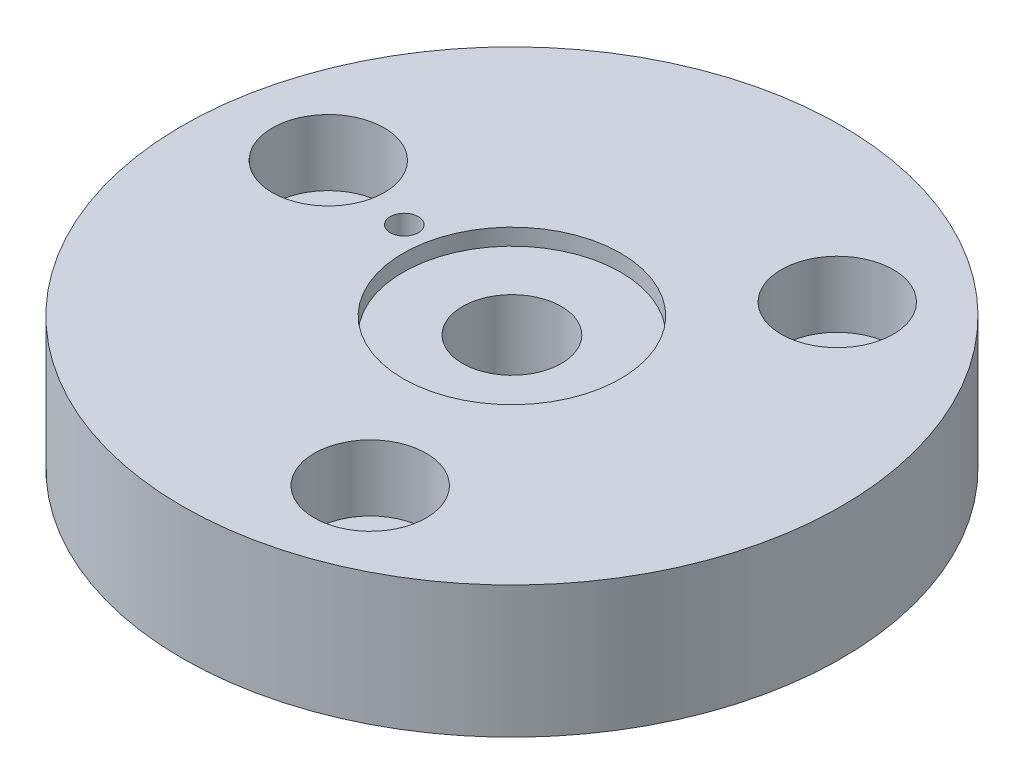
ISO-10303-21;
HEADER;
FILE_DESCRIPTION(('STEP AP214'),'2;1');
FILE_NAME('part.step','',(''),(''),'','','');
FILE_SCHEMA(('AUTOMOTIVE_DESIGN { 1 0 10303 214 1 1 1 1 }'));
ENDSEC;
DATA;
#1=APPLICATION_CONTEXT('core data for automotive mechanical design processes');
#2=APPLICATION_PROTOCOL_DEFINITION('international standard','automotive_design',2000,#1);
#3=PRODUCT_CONTEXT('',#1,'mechanical');
#4=PRODUCT('Part','Part','',(#3));
#5=PRODUCT_RELATED_PRODUCT_CATEGORY('part','',(#4));
#6=PRODUCT_DEFINITION_FORMATION('','',#4);
#7=PRODUCT_DEFINITION_CONTEXT('part definition',#1,'design');
#8=PRODUCT_DEFINITION('design','',#6,#7);
#9=PRODUCT_DEFINITION_SHAPE('','',#8);
#10=(LENGTH_UNIT() NAMED_UNIT(*) SI_UNIT(.MILLI.,.METRE.));
#11=(NAMED_UNIT(*) PLANE_ANGLE_UNIT() SI_UNIT($,.RADIAN.));
#12=(NAMED_UNIT(*) SI_UNIT($,.STERADIAN.) SOLID_ANGLE_UNIT());
#13=UNCERTAINTY_MEASURE_WITH_UNIT(LENGTH_MEASURE(1.E-05),#10,'distance_accuracy_value','');
#14=(GEOMETRIC_REPRESENTATION_CONTEXT(3) GLOBAL_UNCERTAINTY_ASSIGNED_CONTEXT((#13)) GLOBAL_UNIT_ASSIGNED_CONTEXT((#10,
#11,#12)) REPRESENTATION_CONTEXT('',''));
#15=CARTESIAN_POINT('',(0.,0.,0.));
#16=DIRECTION('',(0.,0.,1.));
#17=DIRECTION('',(1.,0.,0.));
#18=AXIS2_PLACEMENT_3D('',#15,#16,#17);
#19=CARTESIAN_POINT('',(45.8020488014566,-40.,-53.1696160562119));
#20=DIRECTION('',(0.,1.,0.));
#21=DIRECTION('',(0.,0.,1.));
#22=AXIS2_PLACEMENT_3D('',#19,#20,#21);
#23=CYLINDRICAL_SURFACE('',#22,8.0000000000045);
#24=CARTESIAN_POINT('',(45.8020488014566,-40.,-53.1696160562119));
#25=DIRECTION('',(0.,1.,0.));
#26=DIRECTION('',(0.,0.,1.));
#27=AXIS2_PLACEMENT_3D('',#24,#25,#26);
#28=CIRCLE('',#27,8.0000000000045);
#29=CARTESIAN_POINT('',(45.8020488014566,-40.,-45.1696160562074));
#30=VERTEX_POINT('',#29);
#31=EDGE_CURVE('E101',#30,#30,#28,.T.);
#32=ORIENTED_EDGE('',*,*,#31,.F.);
#33=EDGE_LOOP('',(#32));
#34=FACE_BOUND('',#33,.T.);
#35=CARTESIAN_POINT('',(45.8020488014566,-20.,-53.1696160562119));
#36=DIRECTION('',(0.,1.,0.));
#37=DIRECTION('',(0.,0.,1.));
#38=AXIS2_PLACEMENT_3D('',#35,#36,#37);
#39=CIRCLE('',#38,8.0000000000045);
#40=CARTESIAN_POINT('',(45.8020488014566,-20.,-45.1696160562074));
#41=VERTEX_POINT('',#40);
#42=EDGE_CURVE('E37',#41,#41,#39,.F.);
#43=ORIENTED_EDGE('',*,*,#42,.F.);
#44=EDGE_LOOP('',(#43));
#45=FACE_BOUND('',#44,.T.);
#46=ADVANCED_FACE('F33',(#34,#45),#23,.F.);
#47=CARTESIAN_POINT('',(23.1452138134145,-40.,66.2505458355371));
#48=DIRECTION('',(0.,1.,0.));
#49=DIRECTION('',(0.,0.,1.));
#50=AXIS2_PLACEMENT_3D('',#47,#48,#49);
#51=CYLINDRICAL_SURFACE('',#50,8.00000000000015);
#52=CARTESIAN_POINT('',(23.1452138134145,-40.,66.2505458355371));
#53=DIRECTION('',(0.,1.,0.));
#54=DIRECTION('',(0.,0.,1.));
#55=AXIS2_PLACEMENT_3D('',#52,#53,#54);
#56=CIRCLE('',#55,8.00000000000015);
#57=CARTESIAN_POINT('',(23.1452138134145,-40.,74.2505458355372));
#58=VERTEX_POINT('',#57);
#59=EDGE_CURVE('E57',#58,#58,#56,.T.);
#60=ORIENTED_EDGE('',*,*,#59,.F.);
#61=EDGE_LOOP('',(#60));
#62=FACE_BOUND('',#61,.T.);
#63=CARTESIAN_POINT('',(23.1452138134145,-20.,66.2505458355371));
#64=DIRECTION('',(0.,1.,0.));
#65=DIRECTION('',(0.,0.,1.));
#66=AXIS2_PLACEMENT_3D('',#63,#64,#65);
#67=CIRCLE('',#66,8.00000000000015);
#68=CARTESIAN_POINT('',(23.1452138134145,-20.,74.2505458355372));
#69=VERTEX_POINT('',#68);
#70=EDGE_CURVE('E70',#69,#69,#67,.F.);
#71=ORIENTED_EDGE('',*,*,#70,.F.);
#72=EDGE_LOOP('',(#71));
#73=FACE_BOUND('',#72,.T.);
#74=ADVANCED_FACE('F35',(#62,#73),#51,.F.);
#75=CARTESIAN_POINT('',(-68.9472626148694,-40.,-13.080929779334));
#76=DIRECTION('',(0.,1.,0.));
#77=DIRECTION('',(0.,0.,1.));
#78=AXIS2_PLACEMENT_3D('',#75,#76,#77);
#79=CYLINDRICAL_SURFACE('',#78,8.);
#80=CARTESIAN_POINT('',(-68.9472626148694,-40.,-13.080929779334));
#81=DIRECTION('',(0.,1.,0.));
#82=DIRECTION('',(0.,0.,1.));
#83=AXIS2_PLACEMENT_3D('',#80,#81,#82);
#84=CIRCLE('',#83,8.);
#85=CARTESIAN_POINT('',(-68.9472626148694,-40.,-5.08092977933395));
#86=VERTEX_POINT('',#85);
#87=EDGE_CURVE('E46',#86,#86,#84,.T.);
#88=ORIENTED_EDGE('',*,*,#87,.F.);
#89=EDGE_LOOP('',(#88));
#90=FACE_BOUND('',#89,.T.);
#91=CARTESIAN_POINT('',(-68.9472626148694,-20.,-13.080929779334));
#92=DIRECTION('',(0.,1.,0.));
#93=DIRECTION('',(0.,0.,1.));
#94=AXIS2_PLACEMENT_3D('',#91,#92,#93);
#95=CIRCLE('',#94,8.);
#96=CARTESIAN_POINT('',(-68.9472626148694,-20.,-5.08092977933395));
#97=VERTEX_POINT('',#96);
#98=EDGE_CURVE('E66',#97,#97,#95,.F.);
#99=ORIENTED_EDGE('',*,*,#98,.F.);
#100=EDGE_LOOP('',(#99));
#101=FACE_BOUND('',#100,.T.);
#102=ADVANCED_FACE('F109',(#90,#101),#79,.F.);
#103=CARTESIAN_POINT('',(0.,-30.,0.));
#104=DIRECTION('',(0.,1.,0.));
#105=DIRECTION('',(0.,0.,1.));
#106=AXIS2_PLACEMENT_3D('',#103,#104,#105);
#107=CYLINDRICAL_SURFACE('',#106,15.);
#108=CARTESIAN_POINT('',(0.,-30.,0.));
#109=DIRECTION('',(0.,1.,0.));
#110=DIRECTION('',(0.,0.,1.));
#111=AXIS2_PLACEMENT_3D('',#108,#109,#110);
#112=CIRCLE('',#111,15.);
#113=CARTESIAN_POINT('',(0.,-30.,15.));
#114=VERTEX_POINT('',#113);
#115=EDGE_CURVE('E61',#114,#114,#112,.T.);
#116=ORIENTED_EDGE('',*,*,#115,.F.);
#117=EDGE_LOOP('',(#116));
#118=FACE_BOUND('',#117,.T.);
#119=CARTESIAN_POINT('',(0.,-5.,0.));
#120=DIRECTION('',(0.,1.,0.));
#121=DIRECTION('',(0.,0.,1.));
#122=AXIS2_PLACEMENT_3D('',#119,#120,#121);
#123=CIRCLE('',#122,15.);
#124=CARTESIAN_POINT('',(0.,-5.,15.));
#125=VERTEX_POINT('',#124);
#126=EDGE_CURVE('E62',#125,#125,#123,.F.);
#127=ORIENTED_EDGE('',*,*,#126,.F.);
#128=EDGE_LOOP('',(#127));
#129=FACE_BOUND('',#128,.T.);
#130=ADVANCED_FACE('F112',(#118,#129),#107,.F.);
#131=CARTESIAN_POINT('',(0.,-40.,0.));
#132=DIRECTION('',(0.,1.,0.));
#133=DIRECTION('',(0.,0.,1.));
#134=AXIS2_PLACEMENT_3D('',#131,#132,#133);
#135=CYLINDRICAL_SURFACE('',#134,5.);
#136=CARTESIAN_POINT('',(0.,-40.,0.));
#137=DIRECTION('',(0.,1.,0.));
#138=DIRECTION('',(0.,0.,1.));
#139=AXIS2_PLACEMENT_3D('',#136,#137,#138);
#140=CIRCLE('',#139,5.);
#141=CARTESIAN_POINT('',(0.,-40.,5.));
#142=VERTEX_POINT('',#141);
#143=EDGE_CURVE('E54',#142,#142,#140,.T.);
#144=ORIENTED_EDGE('',*,*,#143,.F.);
#145=EDGE_LOOP('',(#144));
#146=FACE_BOUND('',#145,.T.);
#147=CARTESIAN_POINT('',(0.,-30.,0.));
#148=DIRECTION('',(0.,1.,0.));
#149=DIRECTION('',(0.,0.,1.));
#150=AXIS2_PLACEMENT_3D('',#147,#148,#149);
#151=CIRCLE('',#150,5.);
#152=CARTESIAN_POINT('',(0.,-30.,5.));
#153=VERTEX_POINT('',#152);
#154=EDGE_CURVE('E58',#153,#153,#151,.F.);
#155=ORIENTED_EDGE('',*,*,#154,.F.);
#156=EDGE_LOOP('',(#155));
#157=FACE_BOUND('',#156,.T.);
#158=ADVANCED_FACE('F146',(#146,#157),#135,.F.);
#159=CARTESIAN_POINT('',(-40.311740852345,-40.,-7.64809263447844));
#160=DIRECTION('',(0.,1.,0.));
#161=DIRECTION('',(0.,0.,1.));
#162=AXIS2_PLACEMENT_3D('',#159,#160,#161);
#163=CYLINDRICAL_SURFACE('',#162,4.25000000000001);
#164=CARTESIAN_POINT('',(-40.311740852345,-40.,-7.64809263447844));
#165=DIRECTION('',(0.,1.,0.));
#166=DIRECTION('',(0.,0.,1.));
#167=AXIS2_PLACEMENT_3D('',#164,#165,#166);
#168=CIRCLE('',#167,4.25000000000001);
#169=CARTESIAN_POINT('',(-40.311740852345,-40.,-3.39809263447844));
#170=VERTEX_POINT('',#169);
#171=EDGE_CURVE('E41',#170,#170,#168,.T.);
#172=ORIENTED_EDGE('',*,*,#171,.F.);
#173=EDGE_LOOP('',(#172));
#174=FACE_BOUND('',#173,.T.);
#175=CARTESIAN_POINT('',(-40.311740852345,0.,-7.64809263447844));
#176=DIRECTION('',(0.,1.,0.));
#177=DIRECTION('',(0.,0.,1.));
#178=AXIS2_PLACEMENT_3D('',#175,#176,#177);
#179=CIRCLE('',#178,4.25000000000001);
#180=CARTESIAN_POINT('',(-40.311740852345,0.,-3.39809263447844));
#181=VERTEX_POINT('',#180);
#182=EDGE_CURVE('E50',#181,#181,#179,.T.);
#183=ORIENTED_EDGE('',*,*,#182,.T.);
#184=EDGE_LOOP('',(#183));
#185=FACE_BOUND('',#184,.T.);
#186=ADVANCED_FACE('F142',(#174,#185),#163,.F.);
#187=CARTESIAN_POINT('',(0.,-40.,0.));
#188=DIRECTION('',(0.,1.,0.));
#189=DIRECTION('',(0.,0.,1.));
#190=AXIS2_PLACEMENT_3D('',#187,#188,#189);
#191=CYLINDRICAL_SURFACE('',#190,100.);
#192=CARTESIAN_POINT('',(0.,-40.,0.));
#193=DIRECTION('',(0.,1.,0.));
#194=DIRECTION('',(0.,0.,1.));
#195=AXIS2_PLACEMENT_3D('',#192,#193,#194);
#196=CIRCLE('',#195,100.);
#197=CARTESIAN_POINT('',(0.,-40.,100.));
#198=VERTEX_POINT('',#197);
#199=EDGE_CURVE('E10',#198,#198,#196,.T.);
#200=ORIENTED_EDGE('',*,*,#199,.T.);
#201=EDGE_LOOP('',(#200));
#202=FACE_BOUND('',#201,.T.);
#203=CARTESIAN_POINT('',(0.,0.,0.));
#204=DIRECTION('',(0.,1.,0.));
#205=DIRECTION('',(0.,0.,1.));
#206=AXIS2_PLACEMENT_3D('',#203,#204,#205);
#207=CIRCLE('',#206,100.);
#208=CARTESIAN_POINT('',(0.,0.,100.));
#209=VERTEX_POINT('',#208);
#210=EDGE_CURVE('E53',#209,#209,#207,.T.);
#211=ORIENTED_EDGE('',*,*,#210,.F.);
#212=EDGE_LOOP('',(#211));
#213=FACE_BOUND('',#212,.T.);
#214=ADVANCED_FACE('F145',(#202,#213),#191,.T.);
#215=CARTESIAN_POINT('',(0.,-40.,0.));
#216=DIRECTION('',(0.,1.,0.));
#217=DIRECTION('',(0.,0.,1.));
#218=AXIS2_PLACEMENT_3D('',#215,#216,#217);
#219=PLANE('',#218);
#220=ORIENTED_EDGE('',*,*,#143,.T.);
#221=EDGE_LOOP('',(#220));
#222=FACE_BOUND('',#221,.T.);
#223=ORIENTED_EDGE('',*,*,#59,.T.);
#224=EDGE_LOOP('',(#223));
#225=FACE_BOUND('',#224,.T.);
#226=ORIENTED_EDGE('',*,*,#31,.T.);
#227=EDGE_LOOP('',(#226));
#228=FACE_BOUND('',#227,.T.);
#229=ORIENTED_EDGE('',*,*,#87,.T.);
#230=EDGE_LOOP('',(#229));
#231=FACE_BOUND('',#230,.T.);
#232=ORIENTED_EDGE('',*,*,#171,.T.);
#233=EDGE_LOOP('',(#232));
#234=FACE_BOUND('',#233,.T.);
#235=ORIENTED_EDGE('',*,*,#199,.F.);
#236=EDGE_LOOP('',(#235));
#237=FACE_BOUND('',#236,.T.);
#238=ADVANCED_FACE('F106',(#222,#225,#228,#231,#234,#237),#219,.F.);
#239=CARTESIAN_POINT('',(0.,0.,0.));
#240=DIRECTION('',(0.,1.,0.));
#241=DIRECTION('',(0.,0.,1.));
#242=AXIS2_PLACEMENT_3D('',#239,#240,#241);
#243=PLANE('',#242);
#244=CARTESIAN_POINT('',(45.6864138988536,0.,-53.0353805026667));
#245=DIRECTION('',(0.,1.,0.));
#246=DIRECTION('',(-0.866025403784443,0.,-0.499999999999992));
#247=AXIS2_PLACEMENT_3D('',#244,#245,#246);
#248=CIRCLE('',#247,17.);
#249=CARTESIAN_POINT('',(30.963982034518,0.,-61.5353805026666));
#250=VERTEX_POINT('',#249);
#251=EDGE_CURVE('E86',#250,#250,#248,.T.);
#252=ORIENTED_EDGE('',*,*,#251,.F.);
#253=EDGE_LOOP('',(#252));
#254=FACE_BOUND('',#253,.T.);
#255=CARTESIAN_POINT('',(23.0867798652562,0.,66.0832852955511));
#256=DIRECTION('',(0.,1.,0.));
#257=DIRECTION('',(0.866025403784436,0.,-0.500000000000004));
#258=AXIS2_PLACEMENT_3D('',#255,#256,#257);
#259=CIRCLE('',#258,17.);
#260=CARTESIAN_POINT('',(37.8092117295916,0.,57.5832852955511));
#261=VERTEX_POINT('',#260);
#262=EDGE_CURVE('E79',#261,#261,#259,.T.);
#263=ORIENTED_EDGE('',*,*,#262,.F.);
#264=EDGE_LOOP('',(#263));
#265=FACE_BOUND('',#264,.T.);
#266=CARTESIAN_POINT('',(-68.77319376411,0.,-13.0479047928849));
#267=DIRECTION('',(0.,1.,0.));
#268=DIRECTION('',(0.,0.,1.));
#269=AXIS2_PLACEMENT_3D('',#266,#267,#268);
#270=CIRCLE('',#269,17.);
#271=CARTESIAN_POINT('',(-68.77319376411,0.,3.95209520711507));
#272=VERTEX_POINT('',#271);
#273=EDGE_CURVE('E72',#272,#272,#270,.T.);
#274=ORIENTED_EDGE('',*,*,#273,.F.);
#275=EDGE_LOOP('',(#274));
#276=FACE_BOUND('',#275,.T.);
#277=CARTESIAN_POINT('',(0.,0.,0.));
#278=DIRECTION('',(0.,1.,0.));
#279=DIRECTION('',(0.,0.,1.));
#280=AXIS2_PLACEMENT_3D('',#277,#278,#279);
#281=CIRCLE('',#280,33.);
#282=CARTESIAN_POINT('',(0.,0.,33.));
#283=VERTEX_POINT('',#282);
#284=EDGE_CURVE('E68',#283,#283,#281,.T.);
#285=ORIENTED_EDGE('',*,*,#284,.F.);
#286=EDGE_LOOP('',(#285));
#287=FACE_BOUND('',#286,.T.);
#288=ORIENTED_EDGE('',*,*,#182,.F.);
#289=EDGE_LOOP('',(#288));
#290=FACE_BOUND('',#289,.T.);
#291=ORIENTED_EDGE('',*,*,#210,.T.);
#292=EDGE_LOOP('',(#291));
#293=FACE_BOUND('',#292,.T.);
#294=ADVANCED_FACE('F150',(#254,#265,#276,#287,#290,#293),#243,.T.);
#295=CARTESIAN_POINT('',(0.,-30.,0.));
#296=DIRECTION('',(0.,1.,0.));
#297=DIRECTION('',(0.,0.,1.));
#298=AXIS2_PLACEMENT_3D('',#295,#296,#297);
#299=PLANE('',#298);
#300=ORIENTED_EDGE('',*,*,#115,.T.);
#301=EDGE_LOOP('',(#300));
#302=FACE_BOUND('',#301,.T.);
#303=ORIENTED_EDGE('',*,*,#154,.T.);
#304=EDGE_LOOP('',(#303));
#305=FACE_BOUND('',#304,.T.);
#306=ADVANCED_FACE('F153',(#302,#305),#299,.T.);
#307=CARTESIAN_POINT('',(0.,-5.,0.));
#308=DIRECTION('',(0.,1.,0.));
#309=DIRECTION('',(0.,0.,1.));
#310=AXIS2_PLACEMENT_3D('',#307,#308,#309);
#311=PLANE('',#310);
#312=CARTESIAN_POINT('',(0.,-5.,0.));
#313=DIRECTION('',(0.,1.,0.));
#314=DIRECTION('',(0.,0.,1.));
#315=AXIS2_PLACEMENT_3D('',#312,#313,#314);
#316=CIRCLE('',#315,33.);
#317=CARTESIAN_POINT('',(0.,-5.,33.));
#318=VERTEX_POINT('',#317);
#319=EDGE_CURVE('E65',#318,#318,#316,.T.);
#320=ORIENTED_EDGE('',*,*,#319,.T.);
#321=EDGE_LOOP('',(#320));
#322=FACE_BOUND('',#321,.T.);
#323=ORIENTED_EDGE('',*,*,#126,.T.);
#324=EDGE_LOOP('',(#323));
#325=FACE_BOUND('',#324,.T.);
#326=ADVANCED_FACE('F129',(#322,#325),#311,.T.);
#327=CARTESIAN_POINT('',(0.,-5.,0.));
#328=DIRECTION('',(0.,1.,0.));
#329=DIRECTION('',(0.,0.,1.));
#330=AXIS2_PLACEMENT_3D('',#327,#328,#329);
#331=CYLINDRICAL_SURFACE('',#330,33.);
#332=ORIENTED_EDGE('',*,*,#319,.F.);
#333=EDGE_LOOP('',(#332));
#334=FACE_BOUND('',#333,.T.);
#335=ORIENTED_EDGE('',*,*,#284,.T.);
#336=EDGE_LOOP('',(#335));
#337=FACE_BOUND('',#336,.T.);
#338=ADVANCED_FACE('F119',(#334,#337),#331,.F.);
#339=CARTESIAN_POINT('',(-68.77319376411,-20.,-13.0479047928849));
#340=DIRECTION('',(0.,1.,0.));
#341=DIRECTION('',(0.,0.,1.));
#342=AXIS2_PLACEMENT_3D('',#339,#340,#341);
#343=PLANE('',#342);
#344=CARTESIAN_POINT('',(-68.77319376411,-20.,-13.0479047928849));
#345=DIRECTION('',(0.,1.,0.));
#346=DIRECTION('',(0.,0.,1.));
#347=AXIS2_PLACEMENT_3D('',#344,#345,#346);
#348=CIRCLE('',#347,17.);
#349=CARTESIAN_POINT('',(-68.77319376411,-20.,3.95209520711507));
#350=VERTEX_POINT('',#349);
#351=EDGE_CURVE('E69',#350,#350,#348,.T.);
#352=ORIENTED_EDGE('',*,*,#351,.T.);
#353=EDGE_LOOP('',(#352));
#354=FACE_BOUND('',#353,.T.);
#355=ORIENTED_EDGE('',*,*,#98,.T.);
#356=EDGE_LOOP('',(#355));
#357=FACE_BOUND('',#356,.T.);
#358=ADVANCED_FACE('F116',(#354,#357),#343,.T.);
#359=CARTESIAN_POINT('',(-68.77319376411,-20.,-13.0479047928849));
#360=DIRECTION('',(0.,1.,0.));
#361=DIRECTION('',(0.,0.,1.));
#362=AXIS2_PLACEMENT_3D('',#359,#360,#361);
#363=CYLINDRICAL_SURFACE('',#362,17.);
#364=ORIENTED_EDGE('',*,*,#351,.F.);
#365=EDGE_LOOP('',(#364));
#366=FACE_BOUND('',#365,.T.);
#367=ORIENTED_EDGE('',*,*,#273,.T.);
#368=EDGE_LOOP('',(#367));
#369=FACE_BOUND('',#368,.T.);
#370=ADVANCED_FACE('F118',(#366,#369),#363,.F.);
#371=CARTESIAN_POINT('',(23.0867798652562,-20.,66.0832852955511));
#372=DIRECTION('',(0.,1.,0.));
#373=DIRECTION('',(0.866025403784436,0.,-0.500000000000004));
#374=AXIS2_PLACEMENT_3D('',#371,#372,#373);
#375=PLANE('',#374);
#376=CARTESIAN_POINT('',(23.0867798652562,-20.,66.0832852955511));
#377=DIRECTION('',(0.,1.,0.));
#378=DIRECTION('',(0.866025403784436,0.,-0.500000000000004));
#379=AXIS2_PLACEMENT_3D('',#376,#377,#378);
#380=CIRCLE('',#379,17.);
#381=CARTESIAN_POINT('',(37.8092117295916,-20.,57.5832852955511));
#382=VERTEX_POINT('',#381);
#383=EDGE_CURVE('E73',#382,#382,#380,.T.);
#384=ORIENTED_EDGE('',*,*,#383,.T.);
#385=EDGE_LOOP('',(#384));
#386=FACE_BOUND('',#385,.T.);
#387=ORIENTED_EDGE('',*,*,#70,.T.);
#388=EDGE_LOOP('',(#387));
#389=FACE_BOUND('',#388,.T.);
#390=ADVANCED_FACE('F126',(#386,#389),#375,.T.);
#391=CARTESIAN_POINT('',(23.0867798652562,-20.,66.0832852955511));
#392=DIRECTION('',(0.,1.,0.));
#393=DIRECTION('',(0.,0.,1.));
#394=AXIS2_PLACEMENT_3D('',#391,#392,#393);
#395=CYLINDRICAL_SURFACE('',#394,17.);
#396=ORIENTED_EDGE('',*,*,#383,.F.);
#397=EDGE_LOOP('',(#396));
#398=FACE_BOUND('',#397,.T.);
#399=ORIENTED_EDGE('',*,*,#262,.T.);
#400=EDGE_LOOP('',(#399));
#401=FACE_BOUND('',#400,.T.);
#402=ADVANCED_FACE('F234',(#398,#401),#395,.F.);
#403=CARTESIAN_POINT('',(45.6864138988536,-20.,-53.0353805026667));
#404=DIRECTION('',(0.,1.,0.));
#405=DIRECTION('',(-0.866025403784443,0.,-0.499999999999992));
#406=AXIS2_PLACEMENT_3D('',#403,#404,#405);
#407=PLANE('',#406);
#408=CARTESIAN_POINT('',(45.6864138988536,-20.,-53.0353805026667));
#409=DIRECTION('',(0.,1.,0.));
#410=DIRECTION('',(-0.866025403784443,0.,-0.499999999999992));
#411=AXIS2_PLACEMENT_3D('',#408,#409,#410);
#412=CIRCLE('',#411,17.);
#413=CARTESIAN_POINT('',(30.963982034518,-20.,-61.5353805026666));
#414=VERTEX_POINT('',#413);
#415=EDGE_CURVE('E269',#414,#414,#412,.T.);
#416=ORIENTED_EDGE('',*,*,#415,.T.);
#417=EDGE_LOOP('',(#416));
#418=FACE_BOUND('',#417,.T.);
#419=ORIENTED_EDGE('',*,*,#42,.T.);
#420=EDGE_LOOP('',(#419));
#421=FACE_BOUND('',#420,.T.);
#422=ADVANCED_FACE('F243',(#418,#421),#407,.T.);
#423=CARTESIAN_POINT('',(45.6864138988536,-20.,-53.0353805026667));
#424=DIRECTION('',(0.,1.,0.));
#425=DIRECTION('',(0.,0.,1.));
#426=AXIS2_PLACEMENT_3D('',#423,#424,#425);
#427=CYLINDRICAL_SURFACE('',#426,17.);
#428=ORIENTED_EDGE('',*,*,#415,.F.);
#429=EDGE_LOOP('',(#428));
#430=FACE_BOUND('',#429,.T.);
#431=ORIENTED_EDGE('',*,*,#251,.T.);
#432=EDGE_LOOP('',(#431));
#433=FACE_BOUND('',#432,.T.);
#434=ADVANCED_FACE('F252',(#430,#433),#427,.F.);
#435=CLOSED_SHELL('',(#46,#74,#102,#130,#158,#186,#214,#238,#294,#306,#326,#338,#358,#370,#390,
#402,#422,#434));
#436=MANIFOLD_SOLID_BREP('B2',#435);
#437=ADVANCED_BREP_SHAPE_REPRESENTATION('',(#18,#436),#14);
#438=SHAPE_DEFINITION_REPRESENTATION(#9,#437);
ENDSEC;
END-ISO-10303-21;
